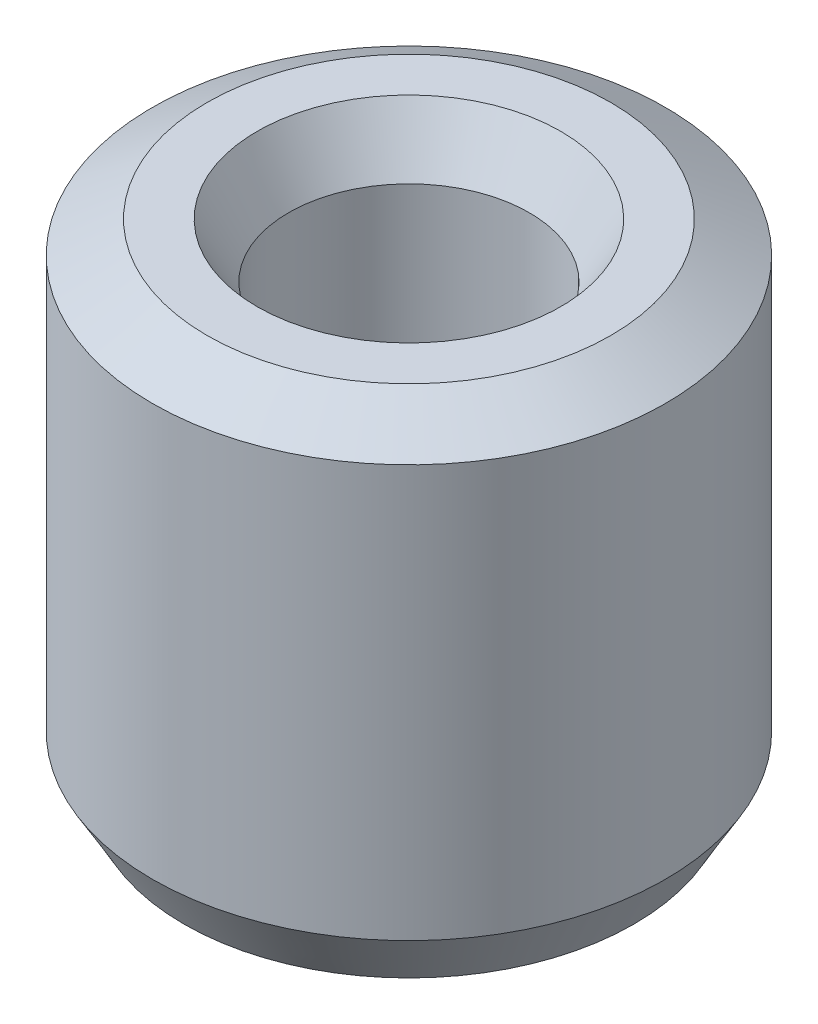
ISO-10303-21;
HEADER;
FILE_DESCRIPTION(('STEP AP214'),'2;1');
FILE_NAME('part.step','',(''),(''),'','','');
FILE_SCHEMA(('AUTOMOTIVE_DESIGN { 1 0 10303 214 1 1 1 1 }'));
ENDSEC;
DATA;
#1=APPLICATION_CONTEXT('core data for automotive mechanical design processes');
#2=APPLICATION_PROTOCOL_DEFINITION('international standard','automotive_design',2000,#1);
#3=PRODUCT_CONTEXT('',#1,'mechanical');
#4=PRODUCT('Part','Part','',(#3));
#5=PRODUCT_RELATED_PRODUCT_CATEGORY('part','',(#4));
#6=PRODUCT_DEFINITION_FORMATION('','',#4);
#7=PRODUCT_DEFINITION_CONTEXT('part definition',#1,'design');
#8=PRODUCT_DEFINITION('design','',#6,#7);
#9=PRODUCT_DEFINITION_SHAPE('','',#8);
#10=(LENGTH_UNIT() NAMED_UNIT(*) SI_UNIT(.MILLI.,.METRE.));
#11=(NAMED_UNIT(*) PLANE_ANGLE_UNIT() SI_UNIT($,.RADIAN.));
#12=(NAMED_UNIT(*) SI_UNIT($,.STERADIAN.) SOLID_ANGLE_UNIT());
#13=UNCERTAINTY_MEASURE_WITH_UNIT(LENGTH_MEASURE(1.E-05),#10,'distance_accuracy_value','');
#14=(GEOMETRIC_REPRESENTATION_CONTEXT(3) GLOBAL_UNCERTAINTY_ASSIGNED_CONTEXT((#13)) GLOBAL_UNIT_ASSIGNED_CONTEXT((#10,
#11,#12)) REPRESENTATION_CONTEXT('',''));
#15=CARTESIAN_POINT('',(0.,0.,0.));
#16=DIRECTION('',(0.,0.,1.));
#17=DIRECTION('',(1.,0.,0.));
#18=AXIS2_PLACEMENT_3D('',#15,#16,#17);
#19=CARTESIAN_POINT('',(0.,58.2773096493938,0.));
#20=DIRECTION('',(0.,-1.,0.));
#21=DIRECTION('',(0.,0.,-1.));
#22=AXIS2_PLACEMENT_3D('',#19,#20,#21);
#23=CYLINDRICAL_SURFACE('',#22,30.);
#24=CARTESIAN_POINT('',(0.,6.39080403102477,0.));
#25=DIRECTION('',(0.,1.,0.));
#26=DIRECTION('',(0.,0.,1.));
#27=AXIS2_PLACEMENT_3D('',#24,#25,#26);
#28=CIRCLE('',#27,30.);
#29=CARTESIAN_POINT('',(0.,6.39080403102477,30.));
#30=VERTEX_POINT('',#29);
#31=EDGE_CURVE('E10',#30,#30,#28,.T.);
#32=ORIENTED_EDGE('',*,*,#31,.T.);
#33=EDGE_LOOP('',(#32));
#34=FACE_BOUND('',#33,.T.);
#35=CARTESIAN_POINT('',(0.,54.5875772217435,0.));
#36=DIRECTION('',(0.,1.,0.));
#37=DIRECTION('',(0.,0.,1.));
#38=AXIS2_PLACEMENT_3D('',#35,#36,#37);
#39=CIRCLE('',#38,30.);
#40=CARTESIAN_POINT('',(0.,54.5875772217435,30.));
#41=VERTEX_POINT('',#40);
#42=EDGE_CURVE('E50',#41,#41,#39,.F.);
#43=ORIENTED_EDGE('',*,*,#42,.T.);
#44=EDGE_LOOP('',(#43));
#45=FACE_BOUND('',#44,.T.);
#46=ADVANCED_FACE('F39',(#34,#45),#23,.T.);
#47=CARTESIAN_POINT('',(0.,58.2773096493938,0.));
#48=DIRECTION('',(0.,1.,0.));
#49=DIRECTION('',(0.,0.,1.));
#50=AXIS2_PLACEMENT_3D('',#47,#48,#49);
#51=PLANE('',#50);
#52=CARTESIAN_POINT('',(0.,58.2773096493938,0.));
#53=DIRECTION('',(0.,1.,0.));
#54=DIRECTION('',(0.,0.,1.));
#55=AXIS2_PLACEMENT_3D('',#52,#53,#54);
#56=CIRCLE('',#55,17.7630700832214);
#57=CARTESIAN_POINT('',(0.,58.2773096493938,17.7630700832214));
#58=VERTEX_POINT('',#57);
#59=EDGE_CURVE('E58',#58,#58,#56,.F.);
#60=ORIENTED_EDGE('',*,*,#59,.T.);
#61=EDGE_LOOP('',(#60));
#62=FACE_BOUND('',#61,.T.);
#63=CARTESIAN_POINT('',(0.,58.2773096493938,0.));
#64=DIRECTION('',(0.,1.,0.));
#65=DIRECTION('',(0.,0.,1.));
#66=AXIS2_PLACEMENT_3D('',#63,#64,#65);
#67=CIRCLE('',#66,23.6091959689753);
#68=CARTESIAN_POINT('',(0.,58.2773096493938,23.6091959689753));
#69=VERTEX_POINT('',#68);
#70=EDGE_CURVE('E61',#69,#69,#67,.T.);
#71=ORIENTED_EDGE('',*,*,#70,.T.);
#72=EDGE_LOOP('',(#71));
#73=FACE_BOUND('',#72,.T.);
#74=ADVANCED_FACE('F88',(#62,#73),#51,.T.);
#75=CARTESIAN_POINT('',(0.,0.,0.));
#76=DIRECTION('',(0.,1.,0.));
#77=DIRECTION('',(0.,0.,1.));
#78=AXIS2_PLACEMENT_3D('',#75,#76,#77);
#79=PLANE('',#78);
#80=CARTESIAN_POINT('',(0.,0.,0.));
#81=DIRECTION('',(0.,1.,0.));
#82=DIRECTION('',(0.,0.,1.));
#83=AXIS2_PLACEMENT_3D('',#80,#81,#82);
#84=CIRCLE('',#83,20.4641416865958);
#85=CARTESIAN_POINT('',(0.,0.,20.4641416865958));
#86=VERTEX_POINT('',#85);
#87=EDGE_CURVE('E51',#86,#86,#84,.T.);
#88=ORIENTED_EDGE('',*,*,#87,.T.);
#89=EDGE_LOOP('',(#88));
#90=FACE_BOUND('',#89,.T.);
#91=CARTESIAN_POINT('',(0.,0.,0.));
#92=DIRECTION('',(0.,1.,0.));
#93=DIRECTION('',(0.,0.,1.));
#94=AXIS2_PLACEMENT_3D('',#91,#92,#93);
#95=CIRCLE('',#94,26.3102675723497);
#96=CARTESIAN_POINT('',(0.,0.,26.3102675723497));
#97=VERTEX_POINT('',#96);
#98=EDGE_CURVE('E54',#97,#97,#95,.F.);
#99=ORIENTED_EDGE('',*,*,#98,.T.);
#100=EDGE_LOOP('',(#99));
#101=FACE_BOUND('',#100,.T.);
#102=ADVANCED_FACE('F83',(#90,#101),#79,.F.);
#103=CARTESIAN_POINT('',(0.,58.2773096493938,0.));
#104=DIRECTION('',(0.,-1.,0.));
#105=DIRECTION('',(0.,0.,-1.));
#106=AXIS2_PLACEMENT_3D('',#103,#104,#105);
#107=CYLINDRICAL_SURFACE('',#106,14.0733376555711);
#108=CARTESIAN_POINT('',(0.,51.8865056183691,0.));
#109=DIRECTION('',(0.,1.,0.));
#110=DIRECTION('',(0.,0.,1.));
#111=AXIS2_PLACEMENT_3D('',#108,#109,#110);
#112=CIRCLE('',#111,14.0733376555711);
#113=CARTESIAN_POINT('',(0.,51.8865056183691,14.0733376555711));
#114=VERTEX_POINT('',#113);
#115=EDGE_CURVE('E67',#114,#114,#112,.T.);
#116=ORIENTED_EDGE('',*,*,#115,.T.);
#117=EDGE_LOOP('',(#116));
#118=FACE_BOUND('',#117,.T.);
#119=CARTESIAN_POINT('',(0.,3.68973242765031,0.));
#120=DIRECTION('',(0.,1.,0.));
#121=DIRECTION('',(0.,0.,1.));
#122=AXIS2_PLACEMENT_3D('',#119,#120,#121);
#123=CIRCLE('',#122,14.0733376555711);
#124=CARTESIAN_POINT('',(0.,3.68973242765031,14.0733376555711));
#125=VERTEX_POINT('',#124);
#126=EDGE_CURVE('E69',#125,#125,#123,.F.);
#127=ORIENTED_EDGE('',*,*,#126,.T.);
#128=EDGE_LOOP('',(#127));
#129=FACE_BOUND('',#128,.T.);
#130=ADVANCED_FACE('F71',(#118,#129),#107,.F.);
#131=CARTESIAN_POINT('',(0.,51.8865056183691,0.));
#132=DIRECTION('',(0.,1.,0.));
#133=DIRECTION('',(0.,0.,1.));
#134=AXIS2_PLACEMENT_3D('',#131,#132,#133);
#135=CONICAL_SURFACE('',#134,14.0733376555711,0.523598775598303);
#136=ORIENTED_EDGE('',*,*,#59,.F.);
#137=EDGE_LOOP('',(#136));
#138=FACE_BOUND('',#137,.T.);
#139=ORIENTED_EDGE('',*,*,#115,.F.);
#140=EDGE_LOOP('',(#139));
#141=FACE_BOUND('',#140,.T.);
#142=ADVANCED_FACE('F77',(#138,#141),#135,.F.);
#143=CARTESIAN_POINT('',(0.,0.,0.));
#144=DIRECTION('',(0.,-1.,0.));
#145=DIRECTION('',(0.,0.,-1.));
#146=AXIS2_PLACEMENT_3D('',#143,#144,#145);
#147=CONICAL_SURFACE('',#146,20.4641416865958,1.04719755119659);
#148=ORIENTED_EDGE('',*,*,#126,.F.);
#149=EDGE_LOOP('',(#148));
#150=FACE_BOUND('',#149,.T.);
#151=ORIENTED_EDGE('',*,*,#87,.F.);
#152=EDGE_LOOP('',(#151));
#153=FACE_BOUND('',#152,.T.);
#154=ADVANCED_FACE('F73',(#150,#153),#147,.F.);
#155=CARTESIAN_POINT('',(0.,6.39080403102477,0.));
#156=DIRECTION('',(0.,1.,0.));
#157=DIRECTION('',(0.,0.,1.));
#158=AXIS2_PLACEMENT_3D('',#155,#156,#157);
#159=CONICAL_SURFACE('',#158,30.,0.523598775598303);
#160=CARTESIAN_POINT('',(0.,0.,26.3102675723497));
#161=CARTESIAN_POINT('',(0.,0.0665708753231742,26.3487022851377));
#162=CARTESIAN_POINT('',(0.,0.133141750646349,26.3871369979257));
#163=CARTESIAN_POINT('',(0.,0.266283501292698,26.4640064235018));
#164=CARTESIAN_POINT('',(0.,0.332854376615872,26.5024411362898));
#165=CARTESIAN_POINT('',(0.,0.465996127262222,26.5793105618658));
#166=CARTESIAN_POINT('',(0.,0.532567002585396,26.6177452746539));
#167=CARTESIAN_POINT('',(0.,0.665708753231745,26.6946147002299));
#168=CARTESIAN_POINT('',(0.,0.73227962855492,26.7330494130179));
#169=CARTESIAN_POINT('',(0.,0.865421379201269,26.809918838594));
#170=CARTESIAN_POINT('',(0.,0.931992254524444,26.848353551382));
#171=CARTESIAN_POINT('',(0.,1.06513400517079,26.9252229769581));
#172=CARTESIAN_POINT('',(0.,1.13170488049397,26.9636576897461));
#173=CARTESIAN_POINT('',(0.,1.26484663114032,27.0405271153221));
#174=CARTESIAN_POINT('',(0.,1.33141750646349,27.0789618281102));
#175=CARTESIAN_POINT('',(0.,1.46455925710984,27.1558312536862));
#176=CARTESIAN_POINT('',(0.,1.53113013243302,27.1942659664742));
#177=CARTESIAN_POINT('',(0.,1.66427188307937,27.2711353920503));
#178=CARTESIAN_POINT('',(0.,1.73084275840254,27.3095701048383));
#179=CARTESIAN_POINT('',(0.,1.86398450904889,27.3864395304143));
#180=CARTESIAN_POINT('',(0.,1.93055538437206,27.4248742432024));
#181=CARTESIAN_POINT('',(0.,2.06369713501841,27.5017436687784));
#182=CARTESIAN_POINT('',(0.,2.13026801034159,27.5401783815664));
#183=CARTESIAN_POINT('',(0.,2.26340976098794,27.6170478071425));
#184=CARTESIAN_POINT('',(0.,2.32998063631111,27.6554825199305));
#185=CARTESIAN_POINT('',(0.,2.46312238695746,27.7323519455066));
#186=CARTESIAN_POINT('',(0.,2.52969326228064,27.7707866582946));
#187=CARTESIAN_POINT('',(0.,2.66283501292699,27.8476560838706));
#188=CARTESIAN_POINT('',(0.,2.72940588825016,27.8860907966587));
#189=CARTESIAN_POINT('',(0.,2.86254763889651,27.9629602222347));
#190=CARTESIAN_POINT('',(0.,2.92911851421968,28.0013949350227));
#191=CARTESIAN_POINT('',(0.,3.06226026486603,28.0782643605988));
#192=CARTESIAN_POINT('',(0.,3.12883114018921,28.1166990733868));
#193=CARTESIAN_POINT('',(0.,3.26197289083556,28.1935684989629));
#194=CARTESIAN_POINT('',(0.,3.32854376615873,28.2320032117509));
#195=CARTESIAN_POINT('',(0.,3.46168551680508,28.3088726373269));
#196=CARTESIAN_POINT('',(0.,3.52825639212826,28.347307350115));
#197=CARTESIAN_POINT('',(0.,3.66139814277461,28.424176775691));
#198=CARTESIAN_POINT('',(0.,3.72796901809778,28.462611488479));
#199=CARTESIAN_POINT('',(0.,3.86111076874413,28.5394809140551));
#200=CARTESIAN_POINT('',(0.,3.9276816440673,28.5779156268431));
#201=CARTESIAN_POINT('',(0.,4.06082339471365,28.6547850524191));
#202=CARTESIAN_POINT('',(0.,4.12739427003683,28.6932197652072));
#203=CARTESIAN_POINT('',(0.,4.26053602068318,28.7700891907832));
#204=CARTESIAN_POINT('',(0.,4.32710689600635,28.8085239035712));
#205=CARTESIAN_POINT('',(0.,4.4602486466527,28.8853933291473));
#206=CARTESIAN_POINT('',(0.,4.52681952197588,28.9238280419353));
#207=CARTESIAN_POINT('',(0.,4.65996127262223,29.0006974675114));
#208=CARTESIAN_POINT('',(0.,4.7265321479454,29.0391321802994));
#209=CARTESIAN_POINT('',(0.,4.85967389859175,29.1160016058754));
#210=CARTESIAN_POINT('',(0.,4.92624477391492,29.1544363186635));
#211=CARTESIAN_POINT('',(0.,5.05938652456127,29.2313057442395));
#212=CARTESIAN_POINT('',(0.,5.12595739988445,29.2697404570275));
#213=CARTESIAN_POINT('',(0.,5.2590991505308,29.3466098826036));
#214=CARTESIAN_POINT('',(0.,5.32567002585397,29.3850445953916));
#215=CARTESIAN_POINT('',(0.,5.45881177650032,29.4619140209677));
#216=CARTESIAN_POINT('',(0.,5.5253826518235,29.5003487337557));
#217=CARTESIAN_POINT('',(0.,5.65852440246984,29.5772181593317));
#218=CARTESIAN_POINT('',(0.,5.72509527779302,29.6156528721198));
#219=CARTESIAN_POINT('',(0.,5.85823702843937,29.6925222976958));
#220=CARTESIAN_POINT('',(0.,5.92480790376254,29.7309570104838));
#221=CARTESIAN_POINT('',(0.,6.05794965440889,29.8078264360599));
#222=CARTESIAN_POINT('',(0.,6.12452052973207,29.8462611488479));
#223=CARTESIAN_POINT('',(0.,6.25766228037842,29.9231305744239));
#224=CARTESIAN_POINT('',(0.,6.32423315570159,29.961565287212));
#225=CARTESIAN_POINT('',(0.,6.39080403102477,30.));
#226=B_SPLINE_CURVE_WITH_KNOTS('',3,(#160,#161,#162,#163,#164,#165,#166,#167,#168,#169,#170,
#171,#172,#173,#174,#175,#176,#177,#178,#179,#180,#181,#182,#183,#184,#185,#186,#187,#188,#189,
#190,#191,#192,#193,#194,#195,#196,#197,#198,#199,#200,#201,#202,#203,#204,#205,#206,#207,#208,
#209,#210,#211,#212,#213,#214,#215,#216,#217,#218,#219,#220,#221,#222,#223,#224,#225),
.UNSPECIFIED.,.F.,.F.,(4,2,2,2,2,2,2,2,2,2,2,2,2,2,2,2,2,2,2,2,2,2,2,2,2,2,2,2,2,2,2,2,4),(0.,
0.230608276728143,0.461216553456287,0.691824830184432,0.922433106912576,1.15304138364072,
1.38364966036886,1.61425793709701,1.84486621382515,2.0754744905533,2.30608276728144,
2.53669104400958,2.76729932073773,2.99790759746587,3.22851587419402,3.45912415092216,
3.6897324276503,3.92034070437845,4.15094898110659,4.38155725783474,4.61216553456288,
4.84277381129102,5.07338208801917,5.30399036474731,5.53459864147545,5.7652069182036,
5.99581519493174,6.22642347165988,6.45703174838803,6.68764002511617,6.91824830184432,
7.14885657857246,7.3794648553006),.UNSPECIFIED.);
#227=EDGE_CURVE('BSEAM76',#97,#30,#226,.T.);
#228=ORIENTED_EDGE('',*,*,#98,.F.);
#229=ORIENTED_EDGE('',*,*,#31,.F.);
#230=ORIENTED_EDGE('',*,*,#227,.T.);
#231=ORIENTED_EDGE('',*,*,#227,.F.);
#232=EDGE_LOOP('',(#228,#230,#229,#231));
#233=FACE_BOUND('',#232,.T.);
#234=ADVANCED_FACE('F76',(#233),#159,.T.);
#235=CARTESIAN_POINT('',(0.,58.2773096493938,0.));
#236=DIRECTION('',(0.,-1.,0.));
#237=DIRECTION('',(0.,0.,-1.));
#238=AXIS2_PLACEMENT_3D('',#235,#236,#237);
#239=CONICAL_SURFACE('',#238,23.6091959689753,1.04719755119659);
#240=ORIENTED_EDGE('',*,*,#42,.F.);
#241=EDGE_LOOP('',(#240));
#242=FACE_BOUND('',#241,.T.);
#243=ORIENTED_EDGE('',*,*,#70,.F.);
#244=EDGE_LOOP('',(#243));
#245=FACE_BOUND('',#244,.T.);
#246=ADVANCED_FACE('F45',(#242,#245),#239,.T.);
#247=CLOSED_SHELL('',(#46,#74,#102,#130,#142,#154,#234,#246));
#248=MANIFOLD_SOLID_BREP('B2',#247);
#249=ADVANCED_BREP_SHAPE_REPRESENTATION('',(#18,#248),#14);
#250=SHAPE_DEFINITION_REPRESENTATION(#9,#249);
ENDSEC;
END-ISO-10303-21;
